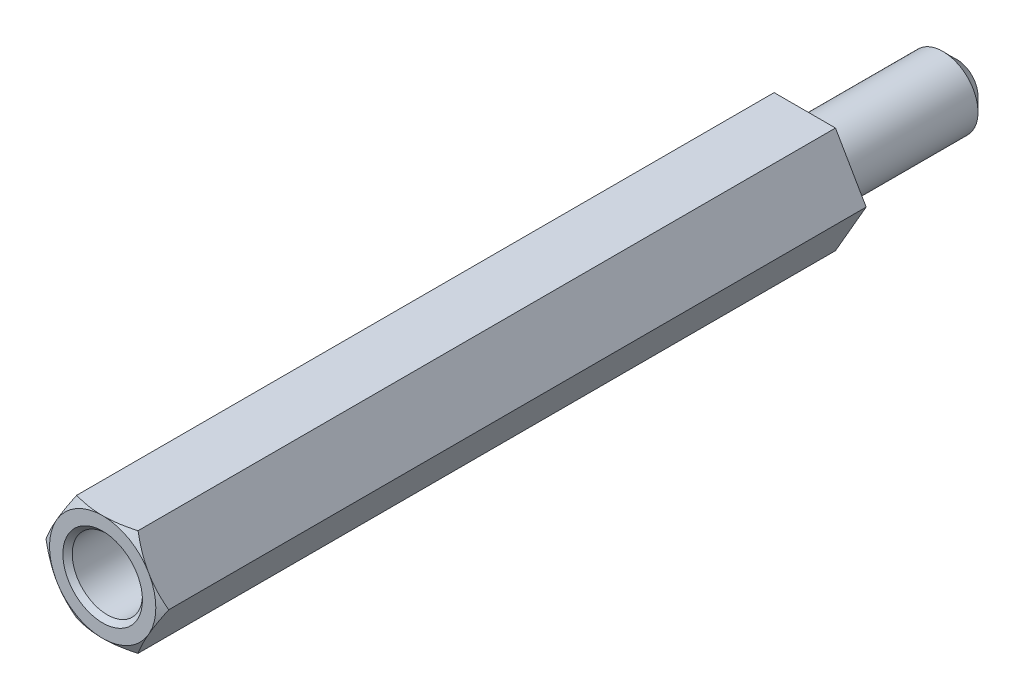
ISO-10303-21;
HEADER;
FILE_DESCRIPTION(('STEP AP214'),'2;1');
FILE_NAME('part.step','',(''),(''),'','','');
FILE_SCHEMA(('AUTOMOTIVE_DESIGN { 1 0 10303 214 1 1 1 1 }'));
ENDSEC;
DATA;
#1=APPLICATION_CONTEXT('core data for automotive mechanical design processes');
#2=APPLICATION_PROTOCOL_DEFINITION('international standard','automotive_design',2000,#1);
#3=PRODUCT_CONTEXT('',#1,'mechanical');
#4=PRODUCT('Part','Part','',(#3));
#5=PRODUCT_RELATED_PRODUCT_CATEGORY('part','',(#4));
#6=PRODUCT_DEFINITION_FORMATION('','',#4);
#7=PRODUCT_DEFINITION_CONTEXT('part definition',#1,'design');
#8=PRODUCT_DEFINITION('design','',#6,#7);
#9=PRODUCT_DEFINITION_SHAPE('','',#8);
#10=(LENGTH_UNIT() NAMED_UNIT(*) SI_UNIT(.MILLI.,.METRE.));
#11=(NAMED_UNIT(*) PLANE_ANGLE_UNIT() SI_UNIT($,.RADIAN.));
#12=(NAMED_UNIT(*) SI_UNIT($,.STERADIAN.) SOLID_ANGLE_UNIT());
#13=UNCERTAINTY_MEASURE_WITH_UNIT(LENGTH_MEASURE(1.E-05),#10,'distance_accuracy_value','');
#14=(GEOMETRIC_REPRESENTATION_CONTEXT(3) GLOBAL_UNCERTAINTY_ASSIGNED_CONTEXT((#13)) GLOBAL_UNIT_ASSIGNED_CONTEXT((#10,
#11,#12)) REPRESENTATION_CONTEXT('',''));
#15=CARTESIAN_POINT('',(0.,0.,0.));
#16=DIRECTION('',(0.,0.,1.));
#17=DIRECTION('',(1.,0.,0.));
#18=AXIS2_PLACEMENT_3D('',#15,#16,#17);
#19=CARTESIAN_POINT('',(0.,0.,30.));
#20=DIRECTION('',(0.,0.,1.));
#21=DIRECTION('',(1.,0.,0.));
#22=AXIS2_PLACEMENT_3D('',#19,#20,#21);
#23=PLANE('',#22);
#24=CARTESIAN_POINT('',(0.,0.,30.));
#25=DIRECTION('',(0.,0.,1.));
#26=DIRECTION('',(1.,0.,0.));
#27=AXIS2_PLACEMENT_3D('',#24,#25,#26);
#28=CIRCLE('',#27,1.7);
#29=CARTESIAN_POINT('',(1.7,0.,30.));
#30=VERTEX_POINT('',#29);
#31=EDGE_CURVE('E162',#30,#30,#28,.F.);
#32=ORIENTED_EDGE('',*,*,#31,.T.);
#33=EDGE_LOOP('',(#32));
#34=FACE_BOUND('',#33,.T.);
#35=CARTESIAN_POINT('',(0.,0.,30.));
#36=DIRECTION('',(0.,0.,1.));
#37=DIRECTION('',(1.,0.,0.));
#38=AXIS2_PLACEMENT_3D('',#35,#36,#37);
#39=CIRCLE('',#38,2.2711702221209);
#40=CARTESIAN_POINT('',(1.92942846272878,-1.19813187298426,30.));
#41=VERTEX_POINT('',#40);
#42=CARTESIAN_POINT('',(0.0728984077241233,-2.27,30.));
#43=VERTEX_POINT('',#42);
#44=EDGE_CURVE('E161',#41,#43,#39,.F.);
#45=ORIENTED_EDGE('',*,*,#44,.F.);
#46=DIRECTION('',(0.499999999999995,0.866025403784442,0.));
#47=VECTOR('',#46,1.);
#48=CARTESIAN_POINT('',(1.31058511106048,-2.26999999999999,30.));
#49=LINE('',#48,#47);
#50=CARTESIAN_POINT('',(2.0023268704526,-1.07186812701572,30.));
#51=VERTEX_POINT('',#50);
#52=EDGE_CURVE('E305',#41,#51,#49,.T.);
#53=ORIENTED_EDGE('',*,*,#52,.T.);
#54=CARTESIAN_POINT('',(2.00232687045273,1.07186812701549,30.));
#55=VERTEX_POINT('',#54);
#56=EDGE_CURVE('E158',#55,#51,#39,.F.);
#57=ORIENTED_EDGE('',*,*,#56,.F.);
#58=DIRECTION('',(-0.500000000000001,0.866025403784438,0.));
#59=VECTOR('',#58,1.);
#60=CARTESIAN_POINT('',(2.6211702221209,0.,30.));
#61=LINE('',#60,#59);
#62=CARTESIAN_POINT('',(1.92942846272862,1.19813187298452,30.));
#63=VERTEX_POINT('',#62);
#64=EDGE_CURVE('E317',#55,#63,#61,.T.);
#65=ORIENTED_EDGE('',*,*,#64,.T.);
#66=CARTESIAN_POINT('',(0.0728984077240917,2.27,30.));
#67=VERTEX_POINT('',#66);
#68=EDGE_CURVE('E160',#67,#63,#39,.F.);
#69=ORIENTED_EDGE('',*,*,#68,.F.);
#70=DIRECTION('',(-1.,0.,0.));
#71=VECTOR('',#70,1.);
#72=CARTESIAN_POINT('',(1.31058511106045,2.27,30.));
#73=LINE('',#72,#71);
#74=CARTESIAN_POINT('',(-0.0728984077241075,2.27,30.));
#75=VERTEX_POINT('',#74);
#76=EDGE_CURVE('E312',#67,#75,#73,.T.);
#77=ORIENTED_EDGE('',*,*,#76,.T.);
#78=CARTESIAN_POINT('',(-1.92942846272863,1.19813187298449,30.));
#79=VERTEX_POINT('',#78);
#80=EDGE_CURVE('E337',#79,#75,#39,.F.);
#81=ORIENTED_EDGE('',*,*,#80,.F.);
#82=DIRECTION('',(-0.499999999999995,-0.866025403784442,0.));
#83=VECTOR('',#82,1.);
#84=CARTESIAN_POINT('',(-1.31058511106046,2.27,30.));
#85=LINE('',#84,#83);
#86=CARTESIAN_POINT('',(-2.00232687045273,1.07186812701548,30.));
#87=VERTEX_POINT('',#86);
#88=EDGE_CURVE('E311',#79,#87,#85,.T.);
#89=ORIENTED_EDGE('',*,*,#88,.T.);
#90=CARTESIAN_POINT('',(-2.00232687045272,-1.0718681270155,30.));
#91=VERTEX_POINT('',#90);
#92=EDGE_CURVE('E122',#91,#87,#39,.F.);
#93=ORIENTED_EDGE('',*,*,#92,.F.);
#94=DIRECTION('',(0.500000000000007,-0.866025403784435,0.));
#95=VECTOR('',#94,1.);
#96=CARTESIAN_POINT('',(-2.6211702221209,0.,30.));
#97=LINE('',#96,#95);
#98=CARTESIAN_POINT('',(-1.92942846272861,-1.19813187298453,30.));
#99=VERTEX_POINT('',#98);
#100=EDGE_CURVE('E138',#91,#99,#97,.T.);
#101=ORIENTED_EDGE('',*,*,#100,.T.);
#102=CARTESIAN_POINT('',(-0.0728984077240759,-2.27,30.));
#103=VERTEX_POINT('',#102);
#104=EDGE_CURVE('E328',#103,#99,#39,.F.);
#105=ORIENTED_EDGE('',*,*,#104,.F.);
#106=DIRECTION('',(1.,0.,0.));
#107=VECTOR('',#106,1.);
#108=CARTESIAN_POINT('',(-1.31058511106043,-2.27000000000001,30.));
#109=LINE('',#108,#107);
#110=EDGE_CURVE('E297',#103,#43,#109,.T.);
#111=ORIENTED_EDGE('',*,*,#110,.T.);
#112=EDGE_LOOP('',(#45,#53,#57,#65,#69,#77,#81,#89,#93,#101,#105,#111));
#113=FACE_BOUND('',#112,.T.);
#114=ADVANCED_FACE('F33',(#34,#113),#23,.T.);
#115=CARTESIAN_POINT('',(1.31058511106048,-2.26999999999999,30.));
#116=DIRECTION('',(-0.866025403784442,0.499999999999995,0.));
#117=DIRECTION('',(-0.499999999999995,-0.866025403784442,0.));
#118=AXIS2_PLACEMENT_3D('',#115,#116,#117);
#119=PLANE('',#118);
#120=DIRECTION('',(0.,0.,-1.));
#121=VECTOR('',#120,1.);
#122=CARTESIAN_POINT('',(2.6211702221209,0.,30.));
#123=LINE('',#122,#121);
#124=CARTESIAN_POINT('',(2.6211702221209,0.,29.8));
#125=VERTEX_POINT('',#124);
#126=CARTESIAN_POINT('',(2.6211702221209,0.,0.));
#127=VERTEX_POINT('',#126);
#128=EDGE_CURVE('E156',#125,#127,#123,.T.);
#129=ORIENTED_EDGE('',*,*,#128,.F.);
#130=CARTESIAN_POINT('',(3.53192502802619,1.5774735970655,29.0874155357182));
#131=CARTESIAN_POINT('',(3.49038683177578,1.50552733070503,29.1258459368283));
#132=CARTESIAN_POINT('',(3.44875020540645,1.43341057837758,29.1638565423728));
#133=CARTESIAN_POINT('',(3.36523806633925,1.28876331046444,29.2388408708484));
#134=CARTESIAN_POINT('',(3.32336252393505,1.21623274342586,29.2758144613019));
#135=CARTESIAN_POINT('',(3.2392041639013,1.07046618796572,29.3486360571844));
#136=CARTESIAN_POINT('',(3.19692046373752,0.997228670950053,29.3844800017565));
#137=CARTESIAN_POINT('',(3.11203872815441,0.850209192285469,29.4546361454567));
#138=CARTESIAN_POINT('',(3.06944070287604,0.776427248201227,29.4889483937519));
#139=CARTESIAN_POINT('',(2.93902958582733,0.550548567601059,29.5907324723442));
#140=CARTESIAN_POINT('',(2.85063034563923,0.397436592244785,29.6552582519314));
#141=CARTESIAN_POINT('',(2.67192637782696,0.0879122404797767,29.7724545253547));
#142=CARTESIAN_POINT('',(2.58162393222904,-0.0684961833435607,29.8251384219436));
#143=CARTESIAN_POINT('',(2.42693241398783,-0.3364297524373,29.8992654299313));
#144=CARTESIAN_POINT('',(2.36310804900723,-0.446976795344526,29.9253337082215));
#145=CARTESIAN_POINT('',(2.23458545503781,-0.669584458020103,29.9666715963234));
#146=CARTESIAN_POINT('',(2.16988756118547,-0.781644497315057,29.9819452339838));
#147=CARTESIAN_POINT('',(2.04077595171338,-1.00527236476771,29.9998836306583));
#148=CARTESIAN_POINT('',(1.97636731130572,-1.11683140240021,30.0026891812466));
#149=CARTESIAN_POINT('',(1.84772217135019,-1.33965132095001,29.9957318097908));
#150=CARTESIAN_POINT('',(1.78348569252727,-1.45091216597063,29.9859674371621));
#151=CARTESIAN_POINT('',(1.63030365883246,-1.71623123113677,29.948841102754));
#152=CARTESIAN_POINT('',(1.54169424329176,-1.86970724088225,29.9160238630181));
#153=CARTESIAN_POINT('',(1.36642171508062,-2.173288164915,29.8337386865889));
#154=CARTESIAN_POINT('',(1.27976131396277,-2.32338838265541,29.7842489190442));
#155=CARTESIAN_POINT('',(1.10733311832963,-2.62204277814945,29.6734296043507));
#156=CARTESIAN_POINT('',(1.02158612689548,-2.77056092390956,29.6119739052285));
#157=CARTESIAN_POINT('',(0.85162252698669,-3.0649465143889,29.4814839194209));
#158=CARTESIAN_POINT('',(0.767405153907273,-3.21081528344244,29.4124535477672));
#159=CARTESIAN_POINT('',(0.635892107966398,-3.43860256087017,29.2999058489882));
#160=CARTESIAN_POINT('',(0.588222071353314,-3.52116948628271,29.258115008667));
#161=CARTESIAN_POINT('',(0.493605207664306,-3.68505070144489,29.1735241810497));
#162=CARTESIAN_POINT('',(0.446655700740952,-3.76636963282645,29.1307361997354));
#163=CARTESIAN_POINT('',(0.399830305155195,-3.84747359706549,29.0874155357182));
#164=B_SPLINE_CURVE_WITH_KNOTS('',3,(#130,#131,#132,#133,#134,#135,#136,#137,#138,#139,#140,
#141,#142,#143,#144,#145,#146,#147,#148,#149,#150,#151,#152,#153,#154,#155,#156,#157,#158,#159,
#160,#161,#162,#163),.UNSPECIFIED.,.F.,.F.,(4,2,2,2,2,2,2,2,2,2,2,2,2,2,2,2,4),(0.,
0.274606048832121,0.549247019939769,0.82478302101826,1.10031017110167,1.66467514911565,
2.22839812072206,2.61888273310893,3.00922156533175,3.39514124414463,3.78110546255825,
4.32061090335238,4.8608255310685,5.40707820220996,5.95304985633502,6.26533246804877,
6.57488685439787),.UNSPECIFIED.);
#165=EDGE_CURVE('E295',#125,#51,#164,.T.);
#166=ORIENTED_EDGE('',*,*,#165,.T.);
#167=ORIENTED_EDGE('',*,*,#52,.F.);
#168=CARTESIAN_POINT('',(1.31058511106048,-2.26999999999999,29.8));
#169=VERTEX_POINT('',#168);
#170=EDGE_CURVE('E139',#41,#169,#164,.T.);
#171=ORIENTED_EDGE('',*,*,#170,.T.);
#172=DIRECTION('',(0.,0.,-1.));
#173=VECTOR('',#172,1.);
#174=CARTESIAN_POINT('',(1.31058511106048,-2.26999999999999,30.));
#175=LINE('',#174,#173);
#176=CARTESIAN_POINT('',(1.31058511106048,-2.26999999999999,0.));
#177=VERTEX_POINT('',#176);
#178=EDGE_CURVE('E151',#169,#177,#175,.T.);
#179=ORIENTED_EDGE('',*,*,#178,.T.);
#180=DIRECTION('',(0.499999999999995,0.866025403784442,0.));
#181=VECTOR('',#180,1.);
#182=CARTESIAN_POINT('',(1.31058511106048,-2.26999999999999,0.));
#183=LINE('',#182,#181);
#184=EDGE_CURVE('E283',#177,#127,#183,.T.);
#185=ORIENTED_EDGE('',*,*,#184,.T.);
#186=EDGE_LOOP('',(#129,#166,#167,#171,#179,#185));
#187=FACE_BOUND('',#186,.T.);
#188=ADVANCED_FACE('F244',(#187),#119,.F.);
#189=CARTESIAN_POINT('',(2.6211702221209,0.,30.));
#190=DIRECTION('',(-0.866025403784438,-0.500000000000001,0.));
#191=DIRECTION('',(0.500000000000001,-0.866025403784438,0.));
#192=AXIS2_PLACEMENT_3D('',#189,#190,#191);
#193=PLANE('',#192);
#194=DIRECTION('',(0.,0.,-1.));
#195=VECTOR('',#194,1.);
#196=CARTESIAN_POINT('',(1.31058511106045,2.27,30.));
#197=LINE('',#196,#195);
#198=CARTESIAN_POINT('',(1.31058511106045,2.27,29.8));
#199=VERTEX_POINT('',#198);
#200=CARTESIAN_POINT('',(1.31058511106045,2.27,0.));
#201=VERTEX_POINT('',#200);
#202=EDGE_CURVE('E149',#199,#201,#197,.T.);
#203=ORIENTED_EDGE('',*,*,#202,.F.);
#204=CARTESIAN_POINT('',(0.399830305155137,3.84747359706553,29.0874155357182));
#205=CARTESIAN_POINT('',(0.441368501405547,3.77552733070505,29.1258459368283));
#206=CARTESIAN_POINT('',(0.483005127774877,3.70341057837761,29.1638565423728));
#207=CARTESIAN_POINT('',(0.566517266842073,3.55876331046447,29.2388408708484));
#208=CARTESIAN_POINT('',(0.608392809246276,3.48623274342588,29.2758144613019));
#209=CARTESIAN_POINT('',(0.692551169280029,3.34046618796575,29.3486360571844));
#210=CARTESIAN_POINT('',(0.734834869443806,3.26722867095008,29.3844800017564));
#211=CARTESIAN_POINT('',(0.819716605026922,3.1202091922855,29.4546361454567));
#212=CARTESIAN_POINT('',(0.862314630305293,3.04642724820126,29.4889483937519));
#213=CARTESIAN_POINT('',(0.992725747353997,2.82054856760109,29.5907324723442));
#214=CARTESIAN_POINT('',(1.0811249875421,2.66743659224481,29.6552582519314));
#215=CARTESIAN_POINT('',(1.25982895535437,2.35791224047981,29.7724545253547));
#216=CARTESIAN_POINT('',(1.3501314009523,2.20150381665647,29.8251384219436));
#217=CARTESIAN_POINT('',(1.50482291919351,1.93357024756273,29.8992654299313));
#218=CARTESIAN_POINT('',(1.56864728417411,1.82302320465551,29.9253337082215));
#219=CARTESIAN_POINT('',(1.69716987814353,1.60041554197993,29.9666715963234));
#220=CARTESIAN_POINT('',(1.76186777199587,1.48835550268498,29.9819452339838));
#221=CARTESIAN_POINT('',(1.89097938146796,1.26472763523233,29.9998836306583));
#222=CARTESIAN_POINT('',(1.95538802187562,1.15316859759983,30.0026891812466));
#223=CARTESIAN_POINT('',(2.08403316183115,0.930348679050028,29.9957318097908));
#224=CARTESIAN_POINT('',(2.14826964065407,0.819087834029409,29.9859674371621));
#225=CARTESIAN_POINT('',(2.30145167434888,0.553768768863274,29.9488411027541));
#226=CARTESIAN_POINT('',(2.39006108988958,0.400292759117802,29.9160238630181));
#227=CARTESIAN_POINT('',(2.56533361810072,0.0967118350850612,29.8337386865889));
#228=CARTESIAN_POINT('',(2.65199401921856,-0.053388382655342,29.7842489190442));
#229=CARTESIAN_POINT('',(2.8244222148517,-0.352042778149366,29.6734296043507));
#230=CARTESIAN_POINT('',(2.91016920628585,-0.500560923909474,29.6119739052286));
#231=CARTESIAN_POINT('',(3.08013280619464,-0.794946514388806,29.4814839194209));
#232=CARTESIAN_POINT('',(3.16435017927405,-0.940815283442336,29.4124535477672));
#233=CARTESIAN_POINT('',(3.29586322521494,-1.16860256087009,29.2999058489882));
#234=CARTESIAN_POINT('',(3.34353326182804,-1.25116948628265,29.258115008667));
#235=CARTESIAN_POINT('',(3.43815012551707,-1.41505070144488,29.1735241810497));
#236=CARTESIAN_POINT('',(3.48509963244044,-1.49636963282646,29.1307361997354));
#237=CARTESIAN_POINT('',(3.53192502802621,-1.57747359706552,29.0874155357182));
#238=B_SPLINE_CURVE_WITH_KNOTS('',3,(#204,#205,#206,#207,#208,#209,#210,#211,#212,#213,#214,
#215,#216,#217,#218,#219,#220,#221,#222,#223,#224,#225,#226,#227,#228,#229,#230,#231,#232,#233,
#234,#235,#236,#237),.UNSPECIFIED.,.F.,.F.,(4,2,2,2,2,2,2,2,2,2,2,2,2,2,2,2,4),(0.,
0.274606048832123,0.54924701993977,0.824783021018261,1.10031017110167,1.66467514911565,
2.22839812072207,2.61888273310893,3.00922156533176,3.39514124414464,3.78110546255825,
4.32061090335236,4.86082553106846,5.40707820220991,5.95304985633495,6.26533246804878,
6.57488685439797),.UNSPECIFIED.);
#239=EDGE_CURVE('E229',#199,#63,#238,.T.);
#240=ORIENTED_EDGE('',*,*,#239,.T.);
#241=ORIENTED_EDGE('',*,*,#64,.F.);
#242=EDGE_CURVE('E326',#55,#125,#238,.T.);
#243=ORIENTED_EDGE('',*,*,#242,.T.);
#244=ORIENTED_EDGE('',*,*,#128,.T.);
#245=DIRECTION('',(-0.500000000000001,0.866025403784438,0.));
#246=VECTOR('',#245,1.);
#247=CARTESIAN_POINT('',(2.6211702221209,0.,0.));
#248=LINE('',#247,#246);
#249=EDGE_CURVE('E288',#127,#201,#248,.T.);
#250=ORIENTED_EDGE('',*,*,#249,.T.);
#251=EDGE_LOOP('',(#203,#240,#241,#243,#244,#250));
#252=FACE_BOUND('',#251,.T.);
#253=ADVANCED_FACE('F239',(#252),#193,.F.);
#254=CARTESIAN_POINT('',(1.31058511106045,2.27,30.));
#255=DIRECTION('',(0.,-1.,0.));
#256=DIRECTION('',(1.,0.,0.));
#257=AXIS2_PLACEMENT_3D('',#254,#255,#256);
#258=PLANE('',#257);
#259=DIRECTION('',(0.,0.,-1.));
#260=VECTOR('',#259,1.);
#261=CARTESIAN_POINT('',(-1.31058511106046,2.27,30.));
#262=LINE('',#261,#260);
#263=CARTESIAN_POINT('',(-1.31058511106046,2.27,29.8));
#264=VERTEX_POINT('',#263);
#265=CARTESIAN_POINT('',(-1.31058511106046,2.27,0.));
#266=VERTEX_POINT('',#265);
#267=EDGE_CURVE('E146',#264,#266,#262,.T.);
#268=ORIENTED_EDGE('',*,*,#267,.F.);
#269=CARTESIAN_POINT('',(-2.88805870812598,2.26999999999999,29.1987324103344));
#270=CARTESIAN_POINT('',(-2.80547290408561,2.26999999999999,29.2358255324642));
#271=CARTESIAN_POINT('',(-2.72266390787582,2.26999999999999,29.2724300278097));
#272=CARTESIAN_POINT('',(-2.55650266128481,2.26999999999999,29.3444249566602));
#273=CARTESIAN_POINT('',(-2.47315031505662,2.26999999999999,29.3798151686687));
#274=CARTESIAN_POINT('',(-2.30548338672952,2.26999999999999,29.4492769222981));
#275=CARTESIAN_POINT('',(-2.22116623150815,2.26999999999999,29.4833422884396));
#276=CARTESIAN_POINT('',(-2.05182779905439,2.26999999999999,29.5496595457378));
#277=CARTESIAN_POINT('',(-1.96680655448942,2.26999999999999,29.5819115204949));
#278=CARTESIAN_POINT('',(-1.71138311857313,2.26999999999999,29.6750656041859));
#279=CARTESIAN_POINT('',(-1.53976972748373,2.26999999999999,29.7327268658694));
#280=CARTESIAN_POINT('',(-1.19280228070998,2.27,29.8349421604164));
#281=CARTESIAN_POINT('',(-1.01745424532612,2.27,29.879515794802));
#282=CARTESIAN_POINT('',(-0.71209077138909,2.27,29.9400719954737));
#283=CARTESIAN_POINT('',(-0.582987722953625,2.27,29.9605553386303));
#284=CARTESIAN_POINT('',(-0.323439084569055,2.27,29.989581233522));
#285=CARTESIAN_POINT('',(-0.192993977067347,2.27,29.9981279349084));
#286=CARTESIAN_POINT('',(0.0680599454393762,2.27,30.0022273630874));
#287=CARTESIAN_POINT('',(0.198668678458181,2.27,29.9977850727737));
#288=CARTESIAN_POINT('',(0.458851198221927,2.27,29.976485692699));
#289=CARTESIAN_POINT('',(0.588424742955677,2.27,29.9596257810572));
#290=CARTESIAN_POINT('',(0.904937752962719,2.27,29.9051607953018));
#291=CARTESIAN_POINT('',(1.09083477493521,2.27,29.8615794043185));
#292=CARTESIAN_POINT('',(1.36639728986909,2.27,29.7844964765957));
#293=CARTESIAN_POINT('',(1.45781153661096,2.27,29.7568102536344));
#294=CARTESIAN_POINT('',(1.63961899594481,2.27000000000001,29.6982591090532));
#295=CARTESIAN_POINT('',(1.73001229033944,2.27000000000001,29.6673944441364));
#296=CARTESIAN_POINT('',(1.91077257487061,2.27000000000001,29.6027837141474));
#297=CARTESIAN_POINT('',(2.00113026057096,2.27000000000001,29.5690119189924));
#298=CARTESIAN_POINT('',(2.18103313876788,2.27000000000001,29.499360278944));
#299=CARTESIAN_POINT('',(2.27057828364603,2.27000000000001,29.4634803114121));
#300=CARTESIAN_POINT('',(2.44846011178725,2.27000000000001,29.3902269588395));
#301=CARTESIAN_POINT('',(2.53680076536778,2.27000000000001,29.352863166806));
#302=CARTESIAN_POINT('',(2.71286376090329,2.27000000000001,29.2767584059864));
#303=CARTESIAN_POINT('',(2.80058623966965,2.27000000000001,29.2380177541729));
#304=CARTESIAN_POINT('',(2.88805870812597,2.27000000000001,29.1987324103344));
#305=B_SPLINE_CURVE_WITH_KNOTS('',3,(#269,#270,#271,#272,#273,#274,#275,#276,#277,#278,#279,
#280,#281,#282,#283,#284,#285,#286,#287,#288,#289,#290,#291,#292,#293,#294,#295,#296,#297,#298,
#299,#300,#301,#302,#303,#304),.UNSPECIFIED.,.F.,.F.,(4,2,2,2,2,2,2,2,2,2,2,2,2,2,2,2,2,4),(0.,
0.271603728461578,0.543256739373973,0.816052841064959,1.08883635604999,1.63163153509609,
2.17360956621752,2.5653004176683,2.95685506788359,3.34825952790363,3.73975296129818,
4.31141566486302,4.59793246001128,4.88442613310069,5.17378506531958,5.46316084709717,
5.75090015934329,6.03857365362724),.UNSPECIFIED.);
#306=EDGE_CURVE('E221',#264,#75,#305,.T.);
#307=ORIENTED_EDGE('',*,*,#306,.T.);
#308=ORIENTED_EDGE('',*,*,#76,.F.);
#309=EDGE_CURVE('E228',#67,#199,#305,.T.);
#310=ORIENTED_EDGE('',*,*,#309,.T.);
#311=ORIENTED_EDGE('',*,*,#202,.T.);
#312=DIRECTION('',(-1.,0.,0.));
#313=VECTOR('',#312,1.);
#314=CARTESIAN_POINT('',(1.31058511106045,2.27,0.));
#315=LINE('',#314,#313);
#316=EDGE_CURVE('E292',#201,#266,#315,.T.);
#317=ORIENTED_EDGE('',*,*,#316,.T.);
#318=EDGE_LOOP('',(#268,#307,#308,#310,#311,#317));
#319=FACE_BOUND('',#318,.T.);
#320=ADVANCED_FACE('F236',(#319),#258,.F.);
#321=CARTESIAN_POINT('',(-1.31058511106046,2.27,30.));
#322=DIRECTION('',(0.866025403784442,-0.499999999999995,0.));
#323=DIRECTION('',(0.499999999999995,0.866025403784442,0.));
#324=AXIS2_PLACEMENT_3D('',#321,#322,#323);
#325=PLANE('',#324);
#326=DIRECTION('',(0.,0.,-1.));
#327=VECTOR('',#326,1.);
#328=CARTESIAN_POINT('',(-2.6211702221209,0.,30.));
#329=LINE('',#328,#327);
#330=CARTESIAN_POINT('',(-2.6211702221209,0.,29.8));
#331=VERTEX_POINT('',#330);
#332=CARTESIAN_POINT('',(-2.6211702221209,0.,0.));
#333=VERTEX_POINT('',#332);
#334=EDGE_CURVE('E134',#331,#333,#329,.T.);
#335=ORIENTED_EDGE('',*,*,#334,.F.);
#336=CARTESIAN_POINT('',(-3.5319250280262,-1.57747359706554,29.0874155357182));
#337=CARTESIAN_POINT('',(-3.49038683177579,-1.50552733070506,29.1258459368283));
#338=CARTESIAN_POINT('',(-3.44875020540646,-1.43341057837762,29.1638565423728));
#339=CARTESIAN_POINT('',(-3.36523806633926,-1.28876331046448,29.2388408708484));
#340=CARTESIAN_POINT('',(-3.32336252393506,-1.2162327434259,29.2758144613019));
#341=CARTESIAN_POINT('',(-3.23920416390131,-1.07046618796576,29.3486360571844));
#342=CARTESIAN_POINT('',(-3.19692046373753,-0.997228670950092,29.3844800017564));
#343=CARTESIAN_POINT('',(-3.11203872815442,-0.850209192285508,29.4546361454567));
#344=CARTESIAN_POINT('',(-3.06944070287605,-0.776427248201265,29.4889483937519));
#345=CARTESIAN_POINT('',(-2.93902958582734,-0.550548567601098,29.5907324723442));
#346=CARTESIAN_POINT('',(-2.85063034563925,-0.397436592244824,29.6552582519314));
#347=CARTESIAN_POINT('',(-2.67192637782698,-0.0879122404798149,29.7724545253547));
#348=CARTESIAN_POINT('',(-2.58162393222905,0.0684961833435221,29.8251384219436));
#349=CARTESIAN_POINT('',(-2.42693241398784,0.336429752437261,29.8992654299313));
#350=CARTESIAN_POINT('',(-2.36310804900724,0.446976795344486,29.9253337082215));
#351=CARTESIAN_POINT('',(-2.23458545503782,0.669584458020063,29.9666715963234));
#352=CARTESIAN_POINT('',(-2.16988756118548,0.781644497315016,29.9819452339838));
#353=CARTESIAN_POINT('',(-2.0407759517134,1.00527236476767,29.9998836306583));
#354=CARTESIAN_POINT('',(-1.97636731130574,1.11683140240017,30.0026891812466));
#355=CARTESIAN_POINT('',(-1.8477221713502,1.33965132094997,29.9957318097908));
#356=CARTESIAN_POINT('',(-1.78348569252728,1.45091216597059,29.9859674371621));
#357=CARTESIAN_POINT('',(-1.63030365883247,1.71623123113672,29.9488411027541));
#358=CARTESIAN_POINT('',(-1.54169424329178,1.8697072408822,29.9160238630181));
#359=CARTESIAN_POINT('',(-1.36642171508064,2.17328816491494,29.8337386865889));
#360=CARTESIAN_POINT('',(-1.2797613139628,2.32338838265535,29.7842489190442));
#361=CARTESIAN_POINT('',(-1.10733311832966,2.62204277814937,29.6734296043507));
#362=CARTESIAN_POINT('',(-1.02158612689552,2.77056092390948,29.6119739052286));
#363=CARTESIAN_POINT('',(-0.851622526986728,3.06494651438882,29.4814839194209));
#364=CARTESIAN_POINT('',(-0.767405153907314,3.21081528344235,29.4124535477672));
#365=CARTESIAN_POINT('',(-0.635892107966429,3.4386025608701,29.2999058489882));
#366=CARTESIAN_POINT('',(-0.588222071353332,3.52116948628266,29.258115008667));
#367=CARTESIAN_POINT('',(-0.4936052076643,3.68505070144488,29.1735241810497));
#368=CARTESIAN_POINT('',(-0.446655700740935,3.76636963282646,29.1307361997354));
#369=CARTESIAN_POINT('',(-0.399830305155167,3.84747359706552,29.0874155357182));
#370=B_SPLINE_CURVE_WITH_KNOTS('',3,(#336,#337,#338,#339,#340,#341,#342,#343,#344,#345,#346,
#347,#348,#349,#350,#351,#352,#353,#354,#355,#356,#357,#358,#359,#360,#361,#362,#363,#364,#365,
#366,#367,#368,#369),.UNSPECIFIED.,.F.,.F.,(4,2,2,2,2,2,2,2,2,2,2,2,2,2,2,2,4),(0.,
0.274606048832123,0.54924701993977,0.82478302101826,1.10031017110167,1.66467514911565,
2.22839812072206,2.61888273310893,3.00922156533175,3.39514124414463,3.78110546255824,
4.32061090335236,4.86082553106847,5.40707820220992,5.95304985633496,6.26533246804878,
6.57488685439796),.UNSPECIFIED.);
#371=EDGE_CURVE('E120',#331,#87,#370,.T.);
#372=ORIENTED_EDGE('',*,*,#371,.T.);
#373=ORIENTED_EDGE('',*,*,#88,.F.);
#374=EDGE_CURVE('E127',#79,#264,#370,.T.);
#375=ORIENTED_EDGE('',*,*,#374,.T.);
#376=ORIENTED_EDGE('',*,*,#267,.T.);
#377=DIRECTION('',(-0.499999999999995,-0.866025403784442,0.));
#378=VECTOR('',#377,1.);
#379=CARTESIAN_POINT('',(-1.31058511106046,2.27,0.));
#380=LINE('',#379,#378);
#381=EDGE_CURVE('E144',#266,#333,#380,.T.);
#382=ORIENTED_EDGE('',*,*,#381,.T.);
#383=EDGE_LOOP('',(#335,#372,#373,#375,#376,#382));
#384=FACE_BOUND('',#383,.T.);
#385=ADVANCED_FACE('F142',(#384),#325,.F.);
#386=CARTESIAN_POINT('',(-2.6211702221209,0.,30.));
#387=DIRECTION('',(0.866025403784435,0.500000000000007,0.));
#388=DIRECTION('',(-0.500000000000007,0.866025403784435,0.));
#389=AXIS2_PLACEMENT_3D('',#386,#387,#388);
#390=PLANE('',#389);
#391=DIRECTION('',(0.,0.,-1.));
#392=VECTOR('',#391,1.);
#393=CARTESIAN_POINT('',(-1.31058511106043,-2.27000000000001,30.));
#394=LINE('',#393,#392);
#395=CARTESIAN_POINT('',(-1.31058511106043,-2.27000000000001,29.8));
#396=VERTEX_POINT('',#395);
#397=CARTESIAN_POINT('',(-1.31058511106043,-2.27000000000001,0.));
#398=VERTEX_POINT('',#397);
#399=EDGE_CURVE('E147',#396,#398,#394,.T.);
#400=ORIENTED_EDGE('',*,*,#399,.F.);
#401=CARTESIAN_POINT('',(-0.399830305155106,-3.84747359706554,29.0874155357182));
#402=CARTESIAN_POINT('',(-0.441368501405517,-3.77552733070506,29.1258459368283));
#403=CARTESIAN_POINT('',(-0.483005127774848,-3.70341057837762,29.1638565423728));
#404=CARTESIAN_POINT('',(-0.566517266842045,-3.55876331046448,29.2388408708484));
#405=CARTESIAN_POINT('',(-0.608392809246248,-3.4862327434259,29.2758144613019));
#406=CARTESIAN_POINT('',(-0.692551169280002,-3.34046618796576,29.3486360571844));
#407=CARTESIAN_POINT('',(-0.734834869443779,-3.26722867095009,29.3844800017564));
#408=CARTESIAN_POINT('',(-0.819716605026896,-3.12020919228551,29.4546361454567));
#409=CARTESIAN_POINT('',(-0.862314630305267,-3.04642724820127,29.4889483937519));
#410=CARTESIAN_POINT('',(-0.992725747353973,-2.8205485676011,29.5907324723442));
#411=CARTESIAN_POINT('',(-1.08112498754207,-2.66743659224483,29.6552582519314));
#412=CARTESIAN_POINT('',(-1.25982895535435,-2.35791224047982,29.7724545253547));
#413=CARTESIAN_POINT('',(-1.35013140095228,-2.20150381665649,29.8251384219436));
#414=CARTESIAN_POINT('',(-1.50482291919349,-1.93357024756275,29.8992654299313));
#415=CARTESIAN_POINT('',(-1.56864728417409,-1.82302320465552,29.9253337082215));
#416=CARTESIAN_POINT('',(-1.69716987814351,-1.60041554197995,29.9666715963234));
#417=CARTESIAN_POINT('',(-1.76186777199585,-1.488355502685,29.9819452339838));
#418=CARTESIAN_POINT('',(-1.89097938146795,-1.26472763523235,29.9998836306583));
#419=CARTESIAN_POINT('',(-1.9553880218756,-1.15316859759985,30.0026891812466));
#420=CARTESIAN_POINT('',(-2.08403316183115,-0.930348679050048,29.9957318097908));
#421=CARTESIAN_POINT('',(-2.14826964065407,-0.81908783402943,29.9859674371621));
#422=CARTESIAN_POINT('',(-2.30145167434888,-0.553768768863296,29.9488411027541));
#423=CARTESIAN_POINT('',(-2.39006108988957,-0.400292759117825,29.9160238630181));
#424=CARTESIAN_POINT('',(-2.56533361810071,-0.0967118350850867,29.8337386865889));
#425=CARTESIAN_POINT('',(-2.65199401921856,0.0533883826553158,29.7842489190442));
#426=CARTESIAN_POINT('',(-2.8244222148517,0.352042778149338,29.6734296043507));
#427=CARTESIAN_POINT('',(-2.91016920628584,0.500560923909445,29.6119739052286));
#428=CARTESIAN_POINT('',(-3.08013280619464,0.794946514388775,29.4814839194209));
#429=CARTESIAN_POINT('',(-3.16435017927405,0.940815283442304,29.4124535477672));
#430=CARTESIAN_POINT('',(-3.29586322521494,1.16860256087006,29.2999058489882));
#431=CARTESIAN_POINT('',(-3.34353326182804,1.25116948628262,29.258115008667));
#432=CARTESIAN_POINT('',(-3.43815012551708,1.41505070144485,29.1735241810497));
#433=CARTESIAN_POINT('',(-3.48509963244045,1.49636963282644,29.1307361997354));
#434=CARTESIAN_POINT('',(-3.53192502802623,1.5774735970655,29.0874155357182));
#435=B_SPLINE_CURVE_WITH_KNOTS('',3,(#401,#402,#403,#404,#405,#406,#407,#408,#409,#410,#411,
#412,#413,#414,#415,#416,#417,#418,#419,#420,#421,#422,#423,#424,#425,#426,#427,#428,#429,#430,
#431,#432,#433,#434),.UNSPECIFIED.,.F.,.F.,(4,2,2,2,2,2,2,2,2,2,2,2,2,2,2,2,4),(0.,
0.274606048832121,0.54924701993977,0.824783021018259,1.10031017110167,1.66467514911565,
2.22839812072207,2.61888273310893,3.00922156533176,3.39514124414464,3.78110546255825,
4.32061090335236,4.86082553106846,5.40707820220991,5.95304985633495,6.26533246804879,
6.57488685439799),.UNSPECIFIED.);
#436=EDGE_CURVE('E141',#396,#99,#435,.T.);
#437=ORIENTED_EDGE('',*,*,#436,.T.);
#438=ORIENTED_EDGE('',*,*,#100,.F.);
#439=EDGE_CURVE('E56',#91,#331,#435,.T.);
#440=ORIENTED_EDGE('',*,*,#439,.T.);
#441=ORIENTED_EDGE('',*,*,#334,.T.);
#442=DIRECTION('',(0.500000000000007,-0.866025403784435,0.));
#443=VECTOR('',#442,1.);
#444=CARTESIAN_POINT('',(-2.6211702221209,0.,0.));
#445=LINE('',#444,#443);
#446=EDGE_CURVE('E303',#333,#398,#445,.T.);
#447=ORIENTED_EDGE('',*,*,#446,.T.);
#448=EDGE_LOOP('',(#400,#437,#438,#440,#441,#447));
#449=FACE_BOUND('',#448,.T.);
#450=ADVANCED_FACE('F132',(#449),#390,.F.);
#451=CARTESIAN_POINT('',(-1.31058511106043,-2.27000000000001,30.));
#452=DIRECTION('',(0.,1.,0.));
#453=DIRECTION('',(-1.,0.,0.));
#454=AXIS2_PLACEMENT_3D('',#451,#452,#453);
#455=PLANE('',#454);
#456=ORIENTED_EDGE('',*,*,#178,.F.);
#457=CARTESIAN_POINT('',(2.888058708126,-2.26999999999997,29.1987324103344));
#458=CARTESIAN_POINT('',(2.80547290408563,-2.26999999999997,29.2358255324642));
#459=CARTESIAN_POINT('',(2.72266390787583,-2.26999999999997,29.2724300278097));
#460=CARTESIAN_POINT('',(2.55650266128482,-2.26999999999997,29.3444249566602));
#461=CARTESIAN_POINT('',(2.47315031505664,-2.26999999999997,29.3798151686687));
#462=CARTESIAN_POINT('',(2.30548338672954,-2.26999999999998,29.4492769222981));
#463=CARTESIAN_POINT('',(2.22116623150817,-2.26999999999998,29.4833422884396));
#464=CARTESIAN_POINT('',(2.05182779905441,-2.26999999999998,29.5496595457378));
#465=CARTESIAN_POINT('',(1.96680655448943,-2.26999999999998,29.5819115204949));
#466=CARTESIAN_POINT('',(1.71138311857314,-2.26999999999998,29.6750656041859));
#467=CARTESIAN_POINT('',(1.53976972748375,-2.26999999999998,29.7327268658694));
#468=CARTESIAN_POINT('',(1.19280228071,-2.26999999999999,29.8349421604164));
#469=CARTESIAN_POINT('',(1.01745424532613,-2.26999999999999,29.879515794802));
#470=CARTESIAN_POINT('',(0.712090771389104,-2.26999999999999,29.9400719954737));
#471=CARTESIAN_POINT('',(0.582987722953639,-2.26999999999999,29.9605553386303));
#472=CARTESIAN_POINT('',(0.323439084569069,-2.27,29.989581233522));
#473=CARTESIAN_POINT('',(0.19299397706736,-2.27,29.9981279349084));
#474=CARTESIAN_POINT('',(-0.0680599454393634,-2.27,30.0022273630874));
#475=CARTESIAN_POINT('',(-0.198668678458168,-2.27,29.9977850727737));
#476=CARTESIAN_POINT('',(-0.458851198221915,-2.27,29.976485692699));
#477=CARTESIAN_POINT('',(-0.588424742955665,-2.27000000000001,29.9596257810572));
#478=CARTESIAN_POINT('',(-0.904937752962707,-2.27000000000001,29.9051607953018));
#479=CARTESIAN_POINT('',(-1.0908347749352,-2.27000000000001,29.8615794043185));
#480=CARTESIAN_POINT('',(-1.36639728986908,-2.27000000000001,29.7844964765957));
#481=CARTESIAN_POINT('',(-1.45781153661095,-2.27000000000002,29.7568102536344));
#482=CARTESIAN_POINT('',(-1.63961899594479,-2.27000000000002,29.6982591090532));
#483=CARTESIAN_POINT('',(-1.73001229033943,-2.27000000000002,29.6673944441364));
#484=CARTESIAN_POINT('',(-1.91077257487059,-2.27000000000002,29.6027837141474));
#485=CARTESIAN_POINT('',(-2.00113026057095,-2.27000000000002,29.5690119189924));
#486=CARTESIAN_POINT('',(-2.18103313876786,-2.27000000000002,29.499360278944));
#487=CARTESIAN_POINT('',(-2.27057828364602,-2.27000000000002,29.4634803114121));
#488=CARTESIAN_POINT('',(-2.44846011178724,-2.27000000000003,29.3902269588395));
#489=CARTESIAN_POINT('',(-2.53680076536777,-2.27000000000003,29.352863166806));
#490=CARTESIAN_POINT('',(-2.71286376090327,-2.27000000000003,29.2767584059864));
#491=CARTESIAN_POINT('',(-2.80058623966963,-2.27000000000003,29.2380177541729));
#492=CARTESIAN_POINT('',(-2.88805870812595,-2.27000000000003,29.1987324103344));
#493=B_SPLINE_CURVE_WITH_KNOTS('',3,(#457,#458,#459,#460,#461,#462,#463,#464,#465,#466,#467,
#468,#469,#470,#471,#472,#473,#474,#475,#476,#477,#478,#479,#480,#481,#482,#483,#484,#485,#486,
#487,#488,#489,#490,#491,#492),.UNSPECIFIED.,.F.,.F.,(4,2,2,2,2,2,2,2,2,2,2,2,2,2,2,2,2,4),(0.,
0.271603728461578,0.543256739373973,0.816052841064959,1.08883635604999,1.63163153509609,
2.17360956621752,2.5653004176683,2.95685506788359,3.34825952790363,3.73975296129818,
4.31141566486302,4.59793246001128,4.88442613310069,5.17378506531958,5.46316084709716,
5.75090015934329,6.03857365362724),.UNSPECIFIED.);
#494=EDGE_CURVE('E182',#169,#43,#493,.T.);
#495=ORIENTED_EDGE('',*,*,#494,.T.);
#496=ORIENTED_EDGE('',*,*,#110,.F.);
#497=EDGE_CURVE('E48',#103,#396,#493,.T.);
#498=ORIENTED_EDGE('',*,*,#497,.T.);
#499=ORIENTED_EDGE('',*,*,#399,.T.);
#500=DIRECTION('',(1.,0.,0.));
#501=VECTOR('',#500,1.);
#502=CARTESIAN_POINT('',(-1.31058511106043,-2.27000000000001,0.));
#503=LINE('',#502,#501);
#504=EDGE_CURVE('E285',#398,#177,#503,.T.);
#505=ORIENTED_EDGE('',*,*,#504,.T.);
#506=EDGE_LOOP('',(#456,#495,#496,#498,#499,#505));
#507=FACE_BOUND('',#506,.T.);
#508=ADVANCED_FACE('F189',(#507),#455,.F.);
#509=CARTESIAN_POINT('',(0.,0.,0.));
#510=DIRECTION('',(0.,0.,1.));
#511=DIRECTION('',(1.,0.,0.));
#512=AXIS2_PLACEMENT_3D('',#509,#510,#511);
#513=PLANE('',#512);
#514=CARTESIAN_POINT('',(0.,0.,0.));
#515=DIRECTION('',(0.,0.,-1.));
#516=DIRECTION('',(-1.,0.,0.));
#517=AXIS2_PLACEMENT_3D('',#514,#515,#516);
#518=CIRCLE('',#517,1.5);
#519=CARTESIAN_POINT('',(-1.5,0.,0.));
#520=VERTEX_POINT('',#519);
#521=EDGE_CURVE('E167',#520,#520,#518,.T.);
#522=ORIENTED_EDGE('',*,*,#521,.F.);
#523=EDGE_LOOP('',(#522));
#524=FACE_BOUND('',#523,.T.);
#525=ORIENTED_EDGE('',*,*,#184,.F.);
#526=ORIENTED_EDGE('',*,*,#504,.F.);
#527=ORIENTED_EDGE('',*,*,#446,.F.);
#528=ORIENTED_EDGE('',*,*,#381,.F.);
#529=ORIENTED_EDGE('',*,*,#316,.F.);
#530=ORIENTED_EDGE('',*,*,#249,.F.);
#531=EDGE_LOOP('',(#525,#526,#527,#528,#529,#530));
#532=FACE_BOUND('',#531,.T.);
#533=ADVANCED_FACE('F269',(#524,#532),#513,.F.);
#534=CARTESIAN_POINT('',(0.,0.,30.000012));
#535=DIRECTION('',(0.,0.,-1.));
#536=DIRECTION('',(-1.,0.,0.));
#537=AXIS2_PLACEMENT_3D('',#534,#535,#536);
#538=CYLINDRICAL_SURFACE('',#537,1.5);
#539=CARTESIAN_POINT('',(0.,0.,29.8));
#540=DIRECTION('',(0.,0.,1.));
#541=DIRECTION('',(1.,0.,0.));
#542=AXIS2_PLACEMENT_3D('',#539,#540,#541);
#543=CIRCLE('',#542,1.5);
#544=CARTESIAN_POINT('',(1.5,0.,29.8));
#545=VERTEX_POINT('',#544);
#546=EDGE_CURVE('E165',#545,#545,#543,.T.);
#547=ORIENTED_EDGE('',*,*,#546,.T.);
#548=EDGE_LOOP('',(#547));
#549=FACE_BOUND('',#548,.T.);
#550=CARTESIAN_POINT('',(0.,0.,18.));
#551=DIRECTION('',(0.,0.,1.));
#552=DIRECTION('',(1.,0.,0.));
#553=AXIS2_PLACEMENT_3D('',#550,#551,#552);
#554=CIRCLE('',#553,1.5);
#555=CARTESIAN_POINT('',(1.5,0.,18.));
#556=VERTEX_POINT('',#555);
#557=EDGE_CURVE('E290',#556,#556,#554,.T.);
#558=ORIENTED_EDGE('',*,*,#557,.F.);
#559=EDGE_LOOP('',(#558));
#560=FACE_BOUND('',#559,.T.);
#561=ADVANCED_FACE('F268',(#549,#560),#538,.F.);
#562=CARTESIAN_POINT('',(0.,0.,18.));
#563=DIRECTION('',(0.,0.,1.));
#564=DIRECTION('',(1.,0.,0.));
#565=AXIS2_PLACEMENT_3D('',#562,#563,#564);
#566=PLANE('',#565);
#567=ORIENTED_EDGE('',*,*,#557,.T.);
#568=EDGE_LOOP('',(#567));
#569=FACE_BOUND('',#568,.T.);
#570=ADVANCED_FACE('F198',(#569),#566,.T.);
#571=CARTESIAN_POINT('',(0.,0.,30.));
#572=DIRECTION('',(0.,0.,-1.));
#573=DIRECTION('',(-1.,0.,0.));
#574=AXIS2_PLACEMENT_3D('',#571,#572,#573);
#575=CONICAL_SURFACE('',#574,2.2711702221209,1.05165021254838);
#576=ORIENTED_EDGE('',*,*,#242,.F.);
#577=ORIENTED_EDGE('',*,*,#56,.T.);
#578=ORIENTED_EDGE('',*,*,#165,.F.);
#579=EDGE_LOOP('',(#576,#577,#578));
#580=FACE_BOUND('',#579,.T.);
#581=ADVANCED_FACE('F192',(#580),#575,.T.);
#582=ORIENTED_EDGE('',*,*,#309,.F.);
#583=ORIENTED_EDGE('',*,*,#68,.T.);
#584=ORIENTED_EDGE('',*,*,#239,.F.);
#585=EDGE_LOOP('',(#582,#583,#584));
#586=FACE_BOUND('',#585,.T.);
#587=ADVANCED_FACE('F197',(#586),#575,.T.);
#588=ORIENTED_EDGE('',*,*,#374,.F.);
#589=ORIENTED_EDGE('',*,*,#80,.T.);
#590=ORIENTED_EDGE('',*,*,#306,.F.);
#591=EDGE_LOOP('',(#588,#589,#590));
#592=FACE_BOUND('',#591,.T.);
#593=ADVANCED_FACE('F340',(#592),#575,.T.);
#594=ORIENTED_EDGE('',*,*,#439,.F.);
#595=ORIENTED_EDGE('',*,*,#92,.T.);
#596=ORIENTED_EDGE('',*,*,#371,.F.);
#597=EDGE_LOOP('',(#594,#595,#596));
#598=FACE_BOUND('',#597,.T.);
#599=ADVANCED_FACE('F121',(#598),#575,.T.);
#600=ORIENTED_EDGE('',*,*,#497,.F.);
#601=ORIENTED_EDGE('',*,*,#104,.T.);
#602=ORIENTED_EDGE('',*,*,#436,.F.);
#603=EDGE_LOOP('',(#600,#601,#602));
#604=FACE_BOUND('',#603,.T.);
#605=ADVANCED_FACE('F200',(#604),#575,.T.);
#606=ORIENTED_EDGE('',*,*,#44,.T.);
#607=ORIENTED_EDGE('',*,*,#494,.F.);
#608=ORIENTED_EDGE('',*,*,#170,.F.);
#609=EDGE_LOOP('',(#606,#607,#608));
#610=FACE_BOUND('',#609,.T.);
#611=ADVANCED_FACE('F251',(#610),#575,.T.);
#612=CARTESIAN_POINT('',(0.,0.,30.));
#613=DIRECTION('',(0.,0.,1.));
#614=DIRECTION('',(1.,0.,0.));
#615=AXIS2_PLACEMENT_3D('',#612,#613,#614);
#616=CONICAL_SURFACE('',#615,1.7,0.785398163397446);
#617=ORIENTED_EDGE('',*,*,#546,.F.);
#618=EDGE_LOOP('',(#617));
#619=FACE_BOUND('',#618,.T.);
#620=ORIENTED_EDGE('',*,*,#31,.F.);
#621=EDGE_LOOP('',(#620));
#622=FACE_BOUND('',#621,.T.);
#623=ADVANCED_FACE('F249',(#619,#622),#616,.F.);
#624=CARTESIAN_POINT('',(0.,0.,-6.5));
#625=DIRECTION('',(0.,0.,1.));
#626=DIRECTION('',(1.,0.,0.));
#627=AXIS2_PLACEMENT_3D('',#624,#625,#626);
#628=CYLINDRICAL_SURFACE('',#627,1.5);
#629=CARTESIAN_POINT('',(0.,0.,-5.90000000000001));
#630=DIRECTION('',(0.,0.,-1.));
#631=DIRECTION('',(-1.,0.,0.));
#632=AXIS2_PLACEMENT_3D('',#629,#630,#631);
#633=CIRCLE('',#632,1.5);
#634=CARTESIAN_POINT('',(-1.5,0.,-5.90000000000001));
#635=VERTEX_POINT('',#634);
#636=EDGE_CURVE('E11',#635,#635,#633,.F.);
#637=ORIENTED_EDGE('',*,*,#636,.T.);
#638=EDGE_LOOP('',(#637));
#639=FACE_BOUND('',#638,.T.);
#640=ORIENTED_EDGE('',*,*,#521,.T.);
#641=EDGE_LOOP('',(#640));
#642=FACE_BOUND('',#641,.T.);
#643=ADVANCED_FACE('F201',(#639,#642),#628,.T.);
#644=CARTESIAN_POINT('',(0.,0.,-6.5));
#645=DIRECTION('',(0.,0.,-1.));
#646=DIRECTION('',(-1.,0.,0.));
#647=AXIS2_PLACEMENT_3D('',#644,#645,#646);
#648=PLANE('',#647);
#649=CARTESIAN_POINT('',(0.,0.,-6.5));
#650=DIRECTION('',(0.,0.,-1.));
#651=DIRECTION('',(-1.,0.,0.));
#652=AXIS2_PLACEMENT_3D('',#649,#650,#651);
#653=CIRCLE('',#652,0.900000000000019);
#654=CARTESIAN_POINT('',(-0.900000000000019,0.,-6.5));
#655=VERTEX_POINT('',#654);
#656=EDGE_CURVE('E41',#655,#655,#653,.T.);
#657=ORIENTED_EDGE('',*,*,#656,.T.);
#658=EDGE_LOOP('',(#657));
#659=FACE_BOUND('',#658,.T.);
#660=ADVANCED_FACE('F257',(#659),#648,.T.);
#661=CARTESIAN_POINT('',(0.,0.,-6.5));
#662=DIRECTION('',(0.,0.,1.));
#663=DIRECTION('',(1.,0.,0.));
#664=AXIS2_PLACEMENT_3D('',#661,#662,#663);
#665=CONICAL_SURFACE('',#664,0.900000000000019,0.785398163397444);
#666=ORIENTED_EDGE('',*,*,#636,.F.);
#667=EDGE_LOOP('',(#666));
#668=FACE_BOUND('',#667,.T.);
#669=ORIENTED_EDGE('',*,*,#656,.F.);
#670=EDGE_LOOP('',(#669));
#671=FACE_BOUND('',#670,.T.);
#672=ADVANCED_FACE('F35',(#668,#671),#665,.T.);
#673=CLOSED_SHELL('',(#114,#188,#253,#320,#385,#450,#508,#533,#561,#570,#581,#587,#593,#599,
#605,#611,#623,#643,#660,#672));
#674=MANIFOLD_SOLID_BREP('B2',#673);
#675=ADVANCED_BREP_SHAPE_REPRESENTATION('',(#18,#674),#14);
#676=SHAPE_DEFINITION_REPRESENTATION(#9,#675);
ENDSEC;
END-ISO-10303-21;
